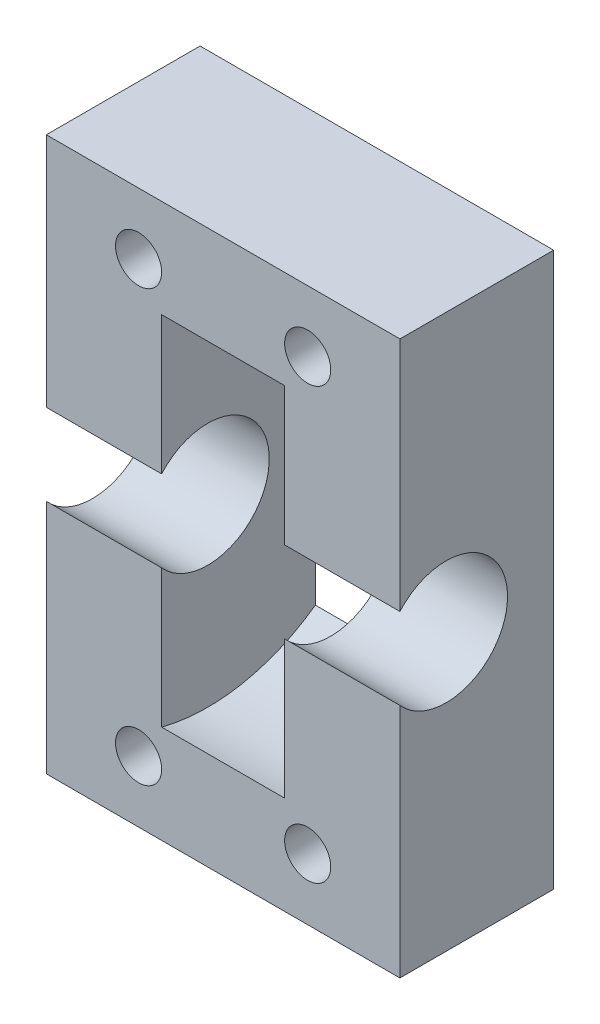
ISO-10303-21;
HEADER;
FILE_DESCRIPTION(('STEP AP214'),'2;1');
FILE_NAME('part.step','',(''),(''),'','','');
FILE_SCHEMA(('AUTOMOTIVE_DESIGN { 1 0 10303 214 1 1 1 1 }'));
ENDSEC;
DATA;
#1=APPLICATION_CONTEXT('core data for automotive mechanical design processes');
#2=APPLICATION_PROTOCOL_DEFINITION('international standard','automotive_design',2000,#1);
#3=PRODUCT_CONTEXT('',#1,'mechanical');
#4=PRODUCT('Part','Part','',(#3));
#5=PRODUCT_RELATED_PRODUCT_CATEGORY('part','',(#4));
#6=PRODUCT_DEFINITION_FORMATION('','',#4);
#7=PRODUCT_DEFINITION_CONTEXT('part definition',#1,'design');
#8=PRODUCT_DEFINITION('design','',#6,#7);
#9=PRODUCT_DEFINITION_SHAPE('','',#8);
#10=(LENGTH_UNIT() NAMED_UNIT(*) SI_UNIT(.MILLI.,.METRE.));
#11=(NAMED_UNIT(*) PLANE_ANGLE_UNIT() SI_UNIT($,.RADIAN.));
#12=(NAMED_UNIT(*) SI_UNIT($,.STERADIAN.) SOLID_ANGLE_UNIT());
#13=UNCERTAINTY_MEASURE_WITH_UNIT(LENGTH_MEASURE(1.E-05),#10,'distance_accuracy_value','');
#14=(GEOMETRIC_REPRESENTATION_CONTEXT(3) GLOBAL_UNCERTAINTY_ASSIGNED_CONTEXT((#13)) GLOBAL_UNIT_ASSIGNED_CONTEXT((#10,
#11,#12)) REPRESENTATION_CONTEXT('',''));
#15=CARTESIAN_POINT('',(0.,0.,0.));
#16=DIRECTION('',(0.,0.,1.));
#17=DIRECTION('',(1.,0.,0.));
#18=AXIS2_PLACEMENT_3D('',#15,#16,#17);
#19=CARTESIAN_POINT('',(23.,17.9999999999999,7.));
#20=DIRECTION('',(-1.,0.,0.));
#21=DIRECTION('',(0.,0.,1.));
#22=AXIS2_PLACEMENT_3D('',#19,#20,#21);
#23=CYLINDRICAL_SURFACE('',#22,4.);
#24=DIRECTION('',(-1.,0.,0.));
#25=VECTOR('',#24,1.);
#26=CARTESIAN_POINT('',(0.,20.6457513110646,9.99999999999999));
#27=LINE('',#26,#25);
#28=CARTESIAN_POINT('',(7.50000000000001,20.6457513110645,9.99999999999999));
#29=VERTEX_POINT('',#28);
#30=CARTESIAN_POINT('',(0.,20.6457513110645,9.99999999999999));
#31=VERTEX_POINT('',#30);
#32=EDGE_CURVE('E149',#29,#31,#27,.T.);
#33=ORIENTED_EDGE('',*,*,#32,.T.);
#34=CARTESIAN_POINT('',(0.,17.9999999999999,7.));
#35=DIRECTION('',(-1.,0.,0.));
#36=DIRECTION('',(0.,0.,1.));
#37=AXIS2_PLACEMENT_3D('',#34,#35,#36);
#38=CIRCLE('',#37,4.);
#39=CARTESIAN_POINT('',(0.,15.3542486889353,9.99999999999999));
#40=VERTEX_POINT('',#39);
#41=EDGE_CURVE('E225',#31,#40,#38,.T.);
#42=ORIENTED_EDGE('',*,*,#41,.T.);
#43=DIRECTION('',(-1.,0.,0.));
#44=VECTOR('',#43,1.);
#45=CARTESIAN_POINT('',(0.,15.3542486889353,9.99999999999999));
#46=LINE('',#45,#44);
#47=CARTESIAN_POINT('',(7.50000000000001,15.3542486889353,9.99999999999999));
#48=VERTEX_POINT('',#47);
#49=EDGE_CURVE('E126',#40,#48,#46,.F.);
#50=ORIENTED_EDGE('',*,*,#49,.T.);
#51=CARTESIAN_POINT('',(7.50000000000001,17.9999999999999,7.));
#52=DIRECTION('',(-1.,0.,0.));
#53=DIRECTION('',(0.,0.,1.));
#54=AXIS2_PLACEMENT_3D('',#51,#52,#53);
#55=CIRCLE('',#54,4.);
#56=EDGE_CURVE('E234',#29,#48,#55,.T.);
#57=ORIENTED_EDGE('',*,*,#56,.F.);
#58=EDGE_LOOP('',(#33,#42,#50,#57));
#59=FACE_BOUND('',#58,.T.);
#60=ADVANCED_FACE('F16',(#59),#23,.F.);
#61=CARTESIAN_POINT('',(23.,17.9999999999999,7.));
#62=DIRECTION('',(-1.,0.,0.));
#63=DIRECTION('',(0.,0.,1.));
#64=AXIS2_PLACEMENT_3D('',#61,#62,#63);
#65=CYLINDRICAL_SURFACE('',#64,4.);
#66=CARTESIAN_POINT('',(15.5,17.9999999999999,7.));
#67=DIRECTION('',(-1.,0.,0.));
#68=DIRECTION('',(0.,0.,1.));
#69=AXIS2_PLACEMENT_3D('',#66,#67,#68);
#70=CIRCLE('',#69,4.);
#71=CARTESIAN_POINT('',(15.5,20.6457513110645,9.99999999999999));
#72=VERTEX_POINT('',#71);
#73=CARTESIAN_POINT('',(15.5,15.3542486889353,9.99999999999999));
#74=VERTEX_POINT('',#73);
#75=EDGE_CURVE('E107',#72,#74,#70,.T.);
#76=ORIENTED_EDGE('',*,*,#75,.T.);
#77=DIRECTION('',(-1.,0.,0.));
#78=VECTOR('',#77,1.);
#79=CARTESIAN_POINT('',(0.,15.3542486889353,9.99999999999999));
#80=LINE('',#79,#78);
#81=CARTESIAN_POINT('',(23.,15.3542486889353,9.99999999999999));
#82=VERTEX_POINT('',#81);
#83=EDGE_CURVE('E110',#74,#82,#80,.F.);
#84=ORIENTED_EDGE('',*,*,#83,.T.);
#85=CARTESIAN_POINT('',(23.,17.9999999999999,7.));
#86=DIRECTION('',(-1.,0.,0.));
#87=DIRECTION('',(0.,0.,1.));
#88=AXIS2_PLACEMENT_3D('',#85,#86,#87);
#89=CIRCLE('',#88,4.);
#90=CARTESIAN_POINT('',(23.,20.6457513110645,9.99999999999999));
#91=VERTEX_POINT('',#90);
#92=EDGE_CURVE('E222',#82,#91,#89,.F.);
#93=ORIENTED_EDGE('',*,*,#92,.T.);
#94=DIRECTION('',(-1.,0.,0.));
#95=VECTOR('',#94,1.);
#96=CARTESIAN_POINT('',(0.,20.6457513110645,9.99999999999999));
#97=LINE('',#96,#95);
#98=EDGE_CURVE('E104',#91,#72,#97,.T.);
#99=ORIENTED_EDGE('',*,*,#98,.T.);
#100=EDGE_LOOP('',(#76,#84,#93,#99));
#101=FACE_BOUND('',#100,.T.);
#102=ADVANCED_FACE('F109',(#101),#65,.F.);
#103=CARTESIAN_POINT('',(0.,35.9999999999999,9.99999999999999));
#104=DIRECTION('',(0.,0.,-1.));
#105=DIRECTION('',(-1.,0.,0.));
#106=AXIS2_PLACEMENT_3D('',#103,#104,#105);
#107=PLANE('',#106);
#108=DIRECTION('',(0.,1.,0.));
#109=VECTOR('',#108,1.);
#110=CARTESIAN_POINT('',(15.5,17.9999999999998,10.));
#111=LINE('',#110,#109);
#112=CARTESIAN_POINT('',(15.5000000000001,29.618950038622,9.99999999999999));
#113=VERTEX_POINT('',#112);
#114=EDGE_CURVE('E116',#113,#72,#111,.F.);
#115=ORIENTED_EDGE('',*,*,#114,.T.);
#116=ORIENTED_EDGE('',*,*,#98,.F.);
#117=DIRECTION('',(0.,1.,0.));
#118=VECTOR('',#117,1.);
#119=CARTESIAN_POINT('',(23.,0.,9.99999999999999));
#120=LINE('',#119,#118);
#121=CARTESIAN_POINT('',(23.,35.9999999999999,10.));
#122=VERTEX_POINT('',#121);
#123=EDGE_CURVE('E194',#91,#122,#120,.T.);
#124=ORIENTED_EDGE('',*,*,#123,.T.);
#125=DIRECTION('',(1.,0.,0.));
#126=VECTOR('',#125,1.);
#127=CARTESIAN_POINT('',(0.,35.9999999999999,10.));
#128=LINE('',#127,#126);
#129=CARTESIAN_POINT('',(0.,35.9999999999999,9.99999999999999));
#130=VERTEX_POINT('',#129);
#131=EDGE_CURVE('E167',#122,#130,#128,.F.);
#132=ORIENTED_EDGE('',*,*,#131,.T.);
#133=DIRECTION('',(0.,1.,0.));
#134=VECTOR('',#133,1.);
#135=CARTESIAN_POINT('',(0.,0.,9.99999999999999));
#136=LINE('',#135,#134);
#137=EDGE_CURVE('E202',#130,#31,#136,.F.);
#138=ORIENTED_EDGE('',*,*,#137,.T.);
#139=ORIENTED_EDGE('',*,*,#32,.F.);
#140=DIRECTION('',(0.,1.,0.));
#141=VECTOR('',#140,1.);
#142=CARTESIAN_POINT('',(7.50000000000001,17.9999999999999,10.));
#143=LINE('',#142,#141);
#144=CARTESIAN_POINT('',(7.50000000000001,29.618950038622,9.99999999999997));
#145=VERTEX_POINT('',#144);
#146=EDGE_CURVE('E238',#145,#29,#143,.F.);
#147=ORIENTED_EDGE('',*,*,#146,.F.);
#148=DIRECTION('',(-1.,0.,0.));
#149=VECTOR('',#148,1.);
#150=CARTESIAN_POINT('',(15.5,29.618950038622,9.99999999999994));
#151=LINE('',#150,#149);
#152=EDGE_CURVE('E138',#145,#113,#151,.F.);
#153=ORIENTED_EDGE('',*,*,#152,.T.);
#154=EDGE_LOOP('',(#115,#116,#124,#132,#138,#139,#147,#153));
#155=FACE_BOUND('',#154,.T.);
#156=CARTESIAN_POINT('',(5.99999999999998,32.,10.));
#157=DIRECTION('',(0.,0.,1.));
#158=DIRECTION('',(1.,0.,0.));
#159=AXIS2_PLACEMENT_3D('',#156,#157,#158);
#160=CIRCLE('',#159,1.5);
#161=CARTESIAN_POINT('',(7.49999999999998,32.,10.));
#162=VERTEX_POINT('',#161);
#163=EDGE_CURVE('E146',#162,#162,#160,.F.);
#164=ORIENTED_EDGE('',*,*,#163,.T.);
#165=EDGE_LOOP('',(#164));
#166=FACE_BOUND('',#165,.T.);
#167=CARTESIAN_POINT('',(17.,32.,10.));
#168=DIRECTION('',(0.,0.,1.));
#169=DIRECTION('',(1.,0.,0.));
#170=AXIS2_PLACEMENT_3D('',#167,#168,#169);
#171=CIRCLE('',#170,1.5);
#172=CARTESIAN_POINT('',(18.5,32.,10.));
#173=VERTEX_POINT('',#172);
#174=EDGE_CURVE('E245',#173,#173,#171,.F.);
#175=ORIENTED_EDGE('',*,*,#174,.T.);
#176=EDGE_LOOP('',(#175));
#177=FACE_BOUND('',#176,.T.);
#178=ADVANCED_FACE('F317',(#155,#166,#177),#107,.F.);
#179=CARTESIAN_POINT('',(0.,35.9999999999999,9.99999999999999));
#180=DIRECTION('',(0.,0.,-1.));
#181=DIRECTION('',(-1.,0.,0.));
#182=AXIS2_PLACEMENT_3D('',#179,#180,#181);
#183=PLANE('',#182);
#184=DIRECTION('',(0.,1.,0.));
#185=VECTOR('',#184,1.);
#186=CARTESIAN_POINT('',(15.5,17.9999999999998,9.99999999999999));
#187=LINE('',#186,#185);
#188=CARTESIAN_POINT('',(15.5,6.38104996137751,10.));
#189=VERTEX_POINT('',#188);
#190=EDGE_CURVE('E115',#74,#189,#187,.F.);
#191=ORIENTED_EDGE('',*,*,#190,.T.);
#192=DIRECTION('',(-1.,0.,0.));
#193=VECTOR('',#192,1.);
#194=CARTESIAN_POINT('',(15.5,6.38104996137752,10.));
#195=LINE('',#194,#193);
#196=CARTESIAN_POINT('',(7.50000000000001,6.38104996137751,10.));
#197=VERTEX_POINT('',#196);
#198=EDGE_CURVE('E199',#189,#197,#195,.T.);
#199=ORIENTED_EDGE('',*,*,#198,.T.);
#200=DIRECTION('',(0.,1.,0.));
#201=VECTOR('',#200,1.);
#202=CARTESIAN_POINT('',(7.50000000000001,17.9999999999999,9.99999999999999));
#203=LINE('',#202,#201);
#204=EDGE_CURVE('E233',#48,#197,#203,.F.);
#205=ORIENTED_EDGE('',*,*,#204,.F.);
#206=ORIENTED_EDGE('',*,*,#49,.F.);
#207=DIRECTION('',(0.,1.,0.));
#208=VECTOR('',#207,1.);
#209=CARTESIAN_POINT('',(0.,0.,10.));
#210=LINE('',#209,#208);
#211=CARTESIAN_POINT('',(0.,0.,10.));
#212=VERTEX_POINT('',#211);
#213=EDGE_CURVE('E170',#40,#212,#210,.F.);
#214=ORIENTED_EDGE('',*,*,#213,.T.);
#215=DIRECTION('',(-1.,0.,0.));
#216=VECTOR('',#215,1.);
#217=CARTESIAN_POINT('',(0.,0.,10.));
#218=LINE('',#217,#216);
#219=CARTESIAN_POINT('',(23.,0.,10.));
#220=VERTEX_POINT('',#219);
#221=EDGE_CURVE('E156',#212,#220,#218,.F.);
#222=ORIENTED_EDGE('',*,*,#221,.T.);
#223=DIRECTION('',(0.,1.,0.));
#224=VECTOR('',#223,1.);
#225=CARTESIAN_POINT('',(23.,0.,10.));
#226=LINE('',#225,#224);
#227=EDGE_CURVE('E123',#220,#82,#226,.T.);
#228=ORIENTED_EDGE('',*,*,#227,.T.);
#229=ORIENTED_EDGE('',*,*,#83,.F.);
#230=EDGE_LOOP('',(#191,#199,#205,#206,#214,#222,#228,#229));
#231=FACE_BOUND('',#230,.T.);
#232=CARTESIAN_POINT('',(17.,4.,10.));
#233=DIRECTION('',(0.,0.,1.));
#234=DIRECTION('',(1.,0.,0.));
#235=AXIS2_PLACEMENT_3D('',#232,#233,#234);
#236=CIRCLE('',#235,1.5);
#237=CARTESIAN_POINT('',(18.5,4.,10.));
#238=VERTEX_POINT('',#237);
#239=EDGE_CURVE('E248',#238,#238,#236,.F.);
#240=ORIENTED_EDGE('',*,*,#239,.T.);
#241=EDGE_LOOP('',(#240));
#242=FACE_BOUND('',#241,.T.);
#243=CARTESIAN_POINT('',(6.00000000000001,4.,10.));
#244=DIRECTION('',(0.,0.,1.));
#245=DIRECTION('',(1.,0.,0.));
#246=AXIS2_PLACEMENT_3D('',#243,#244,#245);
#247=CIRCLE('',#246,1.5);
#248=CARTESIAN_POINT('',(7.50000000000001,4.,10.));
#249=VERTEX_POINT('',#248);
#250=EDGE_CURVE('E19',#249,#249,#247,.F.);
#251=ORIENTED_EDGE('',*,*,#250,.T.);
#252=EDGE_LOOP('',(#251));
#253=FACE_BOUND('',#252,.T.);
#254=ADVANCED_FACE('F119',(#231,#242,#253),#183,.F.);
#255=CARTESIAN_POINT('',(6.00000000000001,4.,0.));
#256=DIRECTION('',(0.,0.,1.));
#257=DIRECTION('',(1.,0.,0.));
#258=AXIS2_PLACEMENT_3D('',#255,#256,#257);
#259=CYLINDRICAL_SURFACE('',#258,1.5);
#260=ORIENTED_EDGE('',*,*,#250,.F.);
#261=EDGE_LOOP('',(#260));
#262=FACE_BOUND('',#261,.T.);
#263=CARTESIAN_POINT('',(6.00000000000001,4.,0.));
#264=DIRECTION('',(0.,0.,1.));
#265=DIRECTION('',(1.,0.,0.));
#266=AXIS2_PLACEMENT_3D('',#263,#264,#265);
#267=CIRCLE('',#266,1.5);
#268=CARTESIAN_POINT('',(7.50000000000001,4.,0.));
#269=VERTEX_POINT('',#268);
#270=EDGE_CURVE('E164',#269,#269,#267,.T.);
#271=ORIENTED_EDGE('',*,*,#270,.F.);
#272=EDGE_LOOP('',(#271));
#273=FACE_BOUND('',#272,.T.);
#274=ADVANCED_FACE('F259',(#262,#273),#259,.F.);
#275=CARTESIAN_POINT('',(17.,4.,0.));
#276=DIRECTION('',(0.,0.,1.));
#277=DIRECTION('',(1.,0.,0.));
#278=AXIS2_PLACEMENT_3D('',#275,#276,#277);
#279=CYLINDRICAL_SURFACE('',#278,1.5);
#280=ORIENTED_EDGE('',*,*,#239,.F.);
#281=EDGE_LOOP('',(#280));
#282=FACE_BOUND('',#281,.T.);
#283=CARTESIAN_POINT('',(17.,4.,0.));
#284=DIRECTION('',(0.,0.,1.));
#285=DIRECTION('',(1.,0.,0.));
#286=AXIS2_PLACEMENT_3D('',#283,#284,#285);
#287=CIRCLE('',#286,1.5);
#288=CARTESIAN_POINT('',(18.5,4.,0.));
#289=VERTEX_POINT('',#288);
#290=EDGE_CURVE('E215',#289,#289,#287,.T.);
#291=ORIENTED_EDGE('',*,*,#290,.F.);
#292=EDGE_LOOP('',(#291));
#293=FACE_BOUND('',#292,.T.);
#294=ADVANCED_FACE('F262',(#282,#293),#279,.F.);
#295=CARTESIAN_POINT('',(17.,32.,0.));
#296=DIRECTION('',(0.,0.,1.));
#297=DIRECTION('',(1.,0.,0.));
#298=AXIS2_PLACEMENT_3D('',#295,#296,#297);
#299=CYLINDRICAL_SURFACE('',#298,1.5);
#300=ORIENTED_EDGE('',*,*,#174,.F.);
#301=EDGE_LOOP('',(#300));
#302=FACE_BOUND('',#301,.T.);
#303=CARTESIAN_POINT('',(17.,32.,0.));
#304=DIRECTION('',(0.,0.,1.));
#305=DIRECTION('',(1.,0.,0.));
#306=AXIS2_PLACEMENT_3D('',#303,#304,#305);
#307=CIRCLE('',#306,1.5);
#308=CARTESIAN_POINT('',(18.5,32.,0.));
#309=VERTEX_POINT('',#308);
#310=EDGE_CURVE('E211',#309,#309,#307,.T.);
#311=ORIENTED_EDGE('',*,*,#310,.F.);
#312=EDGE_LOOP('',(#311));
#313=FACE_BOUND('',#312,.T.);
#314=ADVANCED_FACE('F307',(#302,#313),#299,.F.);
#315=CARTESIAN_POINT('',(5.99999999999998,32.,0.));
#316=DIRECTION('',(0.,0.,1.));
#317=DIRECTION('',(1.,0.,0.));
#318=AXIS2_PLACEMENT_3D('',#315,#316,#317);
#319=CYLINDRICAL_SURFACE('',#318,1.5);
#320=ORIENTED_EDGE('',*,*,#163,.F.);
#321=EDGE_LOOP('',(#320));
#322=FACE_BOUND('',#321,.T.);
#323=CARTESIAN_POINT('',(5.99999999999998,32.,0.));
#324=DIRECTION('',(0.,0.,1.));
#325=DIRECTION('',(1.,0.,0.));
#326=AXIS2_PLACEMENT_3D('',#323,#324,#325);
#327=CIRCLE('',#326,1.5);
#328=CARTESIAN_POINT('',(7.49999999999998,32.,0.));
#329=VERTEX_POINT('',#328);
#330=EDGE_CURVE('E207',#329,#329,#327,.T.);
#331=ORIENTED_EDGE('',*,*,#330,.F.);
#332=EDGE_LOOP('',(#331));
#333=FACE_BOUND('',#332,.T.);
#334=ADVANCED_FACE('F304',(#322,#333),#319,.F.);
#335=CARTESIAN_POINT('',(15.5,17.9999999999998,7.));
#336=DIRECTION('',(1.,0.,0.));
#337=DIRECTION('',(0.,0.,-1.));
#338=AXIS2_PLACEMENT_3D('',#335,#336,#337);
#339=PLANE('',#338);
#340=CARTESIAN_POINT('',(15.5,17.9999999999998,7.));
#341=DIRECTION('',(-1.,0.,0.));
#342=DIRECTION('',(0.,0.,1.));
#343=AXIS2_PLACEMENT_3D('',#340,#341,#342);
#344=CIRCLE('',#343,12.);
#345=CARTESIAN_POINT('',(15.5,8.25320565519091,0.));
#346=VERTEX_POINT('',#345);
#347=EDGE_CURVE('E130',#346,#189,#344,.T.);
#348=ORIENTED_EDGE('',*,*,#347,.T.);
#349=ORIENTED_EDGE('',*,*,#190,.F.);
#350=ORIENTED_EDGE('',*,*,#75,.F.);
#351=ORIENTED_EDGE('',*,*,#114,.F.);
#352=CARTESIAN_POINT('',(15.5000000000002,17.9999999999998,7.));
#353=DIRECTION('',(-1.,0.,0.));
#354=DIRECTION('',(0.,0.,1.));
#355=AXIS2_PLACEMENT_3D('',#352,#353,#354);
#356=CIRCLE('',#355,12.);
#357=CARTESIAN_POINT('',(15.5000000000001,27.7467943448088,0.));
#358=VERTEX_POINT('',#357);
#359=EDGE_CURVE('E133',#113,#358,#356,.T.);
#360=ORIENTED_EDGE('',*,*,#359,.T.);
#361=DIRECTION('',(0.,1.,0.));
#362=VECTOR('',#361,1.);
#363=CARTESIAN_POINT('',(15.5,35.9999999999999,0.));
#364=LINE('',#363,#362);
#365=EDGE_CURVE('E142',#346,#358,#364,.T.);
#366=ORIENTED_EDGE('',*,*,#365,.F.);
#367=EDGE_LOOP('',(#348,#349,#350,#351,#360,#366));
#368=FACE_BOUND('',#367,.T.);
#369=ADVANCED_FACE('F128',(#368),#339,.F.);
#370=CARTESIAN_POINT('',(15.5,17.9999999999998,7.));
#371=DIRECTION('',(-1.,0.,0.));
#372=DIRECTION('',(0.,0.,1.));
#373=AXIS2_PLACEMENT_3D('',#370,#371,#372);
#374=CYLINDRICAL_SURFACE('',#373,12.);
#375=CARTESIAN_POINT('',(7.50000000000001,17.9999999999998,7.));
#376=DIRECTION('',(-1.,0.,0.));
#377=DIRECTION('',(0.,0.,1.));
#378=AXIS2_PLACEMENT_3D('',#375,#376,#377);
#379=CIRCLE('',#378,12.);
#380=CARTESIAN_POINT('',(7.50000000000001,27.7467943448088,0.));
#381=VERTEX_POINT('',#380);
#382=EDGE_CURVE('E206',#381,#145,#379,.F.);
#383=ORIENTED_EDGE('',*,*,#382,.F.);
#384=DIRECTION('',(-1.,0.,0.));
#385=VECTOR('',#384,1.);
#386=CARTESIAN_POINT('',(0.,27.7467943448088,0.));
#387=LINE('',#386,#385);
#388=EDGE_CURVE('E357',#358,#381,#387,.T.);
#389=ORIENTED_EDGE('',*,*,#388,.F.);
#390=ORIENTED_EDGE('',*,*,#359,.F.);
#391=ORIENTED_EDGE('',*,*,#152,.F.);
#392=EDGE_LOOP('',(#383,#389,#390,#391));
#393=FACE_BOUND('',#392,.T.);
#394=ADVANCED_FACE('F297',(#393),#374,.F.);
#395=CARTESIAN_POINT('',(7.50000000000001,17.9999999999999,7.00000000000001));
#396=DIRECTION('',(1.,0.,0.));
#397=DIRECTION('',(0.,0.,-1.));
#398=AXIS2_PLACEMENT_3D('',#395,#396,#397);
#399=PLANE('',#398);
#400=CARTESIAN_POINT('',(7.50000000000001,17.9999999999998,7.));
#401=DIRECTION('',(-1.,0.,0.));
#402=DIRECTION('',(0.,0.,1.));
#403=AXIS2_PLACEMENT_3D('',#400,#401,#402);
#404=CIRCLE('',#403,12.);
#405=CARTESIAN_POINT('',(7.50000000000001,8.25320565519091,0.));
#406=VERTEX_POINT('',#405);
#407=EDGE_CURVE('E230',#197,#406,#404,.F.);
#408=ORIENTED_EDGE('',*,*,#407,.T.);
#409=DIRECTION('',(0.,1.,0.));
#410=VECTOR('',#409,1.);
#411=CARTESIAN_POINT('',(7.50000000000001,35.9999999999999,0.));
#412=LINE('',#411,#410);
#413=EDGE_CURVE('E361',#381,#406,#412,.F.);
#414=ORIENTED_EDGE('',*,*,#413,.F.);
#415=ORIENTED_EDGE('',*,*,#382,.T.);
#416=ORIENTED_EDGE('',*,*,#146,.T.);
#417=ORIENTED_EDGE('',*,*,#56,.T.);
#418=ORIENTED_EDGE('',*,*,#204,.T.);
#419=EDGE_LOOP('',(#408,#414,#415,#416,#417,#418));
#420=FACE_BOUND('',#419,.T.);
#421=ADVANCED_FACE('F293',(#420),#399,.T.);
#422=CARTESIAN_POINT('',(15.5,17.9999999999998,7.));
#423=DIRECTION('',(-1.,0.,0.));
#424=DIRECTION('',(0.,0.,1.));
#425=AXIS2_PLACEMENT_3D('',#422,#423,#424);
#426=CYLINDRICAL_SURFACE('',#425,12.);
#427=ORIENTED_EDGE('',*,*,#347,.F.);
#428=DIRECTION('',(-1.,0.,0.));
#429=VECTOR('',#428,1.);
#430=CARTESIAN_POINT('',(0.,8.25320565519103,0.));
#431=LINE('',#430,#429);
#432=EDGE_CURVE('E364',#406,#346,#431,.F.);
#433=ORIENTED_EDGE('',*,*,#432,.F.);
#434=ORIENTED_EDGE('',*,*,#407,.F.);
#435=ORIENTED_EDGE('',*,*,#198,.F.);
#436=EDGE_LOOP('',(#427,#433,#434,#435));
#437=FACE_BOUND('',#436,.T.);
#438=ADVANCED_FACE('F289',(#437),#426,.F.);
#439=CARTESIAN_POINT('',(0.,0.,10.));
#440=DIRECTION('',(1.,0.,0.));
#441=DIRECTION('',(0.,0.,-1.));
#442=AXIS2_PLACEMENT_3D('',#439,#440,#441);
#443=PLANE('',#442);
#444=ORIENTED_EDGE('',*,*,#41,.F.);
#445=ORIENTED_EDGE('',*,*,#137,.F.);
#446=DIRECTION('',(0.,0.,1.));
#447=VECTOR('',#446,1.);
#448=CARTESIAN_POINT('',(0.,35.9999999999999,9.99999999999999));
#449=LINE('',#448,#447);
#450=CARTESIAN_POINT('',(0.,35.9999999999999,0.));
#451=VERTEX_POINT('',#450);
#452=EDGE_CURVE('E153',#130,#451,#449,.F.);
#453=ORIENTED_EDGE('',*,*,#452,.T.);
#454=DIRECTION('',(0.,1.,0.));
#455=VECTOR('',#454,1.);
#456=CARTESIAN_POINT('',(0.,35.9999999999999,0.));
#457=LINE('',#456,#455);
#458=CARTESIAN_POINT('',(0.,0.,0.));
#459=VERTEX_POINT('',#458);
#460=EDGE_CURVE('E182',#459,#451,#457,.T.);
#461=ORIENTED_EDGE('',*,*,#460,.F.);
#462=DIRECTION('',(0.,0.,1.));
#463=VECTOR('',#462,1.);
#464=CARTESIAN_POINT('',(0.,0.,10.));
#465=LINE('',#464,#463);
#466=EDGE_CURVE('E159',#459,#212,#465,.T.);
#467=ORIENTED_EDGE('',*,*,#466,.T.);
#468=ORIENTED_EDGE('',*,*,#213,.F.);
#469=EDGE_LOOP('',(#444,#445,#453,#461,#467,#468));
#470=FACE_BOUND('',#469,.T.);
#471=ADVANCED_FACE('F285',(#470),#443,.F.);
#472=CARTESIAN_POINT('',(0.,35.9999999999999,9.99999999999999));
#473=DIRECTION('',(0.,-1.,0.));
#474=DIRECTION('',(1.,0.,0.));
#475=AXIS2_PLACEMENT_3D('',#472,#473,#474);
#476=PLANE('',#475);
#477=ORIENTED_EDGE('',*,*,#452,.F.);
#478=ORIENTED_EDGE('',*,*,#131,.F.);
#479=DIRECTION('',(0.,0.,1.));
#480=VECTOR('',#479,1.);
#481=CARTESIAN_POINT('',(23.,35.9999999999999,10.));
#482=LINE('',#481,#480);
#483=CARTESIAN_POINT('',(23.,35.9999999999999,0.));
#484=VERTEX_POINT('',#483);
#485=EDGE_CURVE('E150',#122,#484,#482,.F.);
#486=ORIENTED_EDGE('',*,*,#485,.T.);
#487=DIRECTION('',(-1.,0.,0.));
#488=VECTOR('',#487,1.);
#489=CARTESIAN_POINT('',(0.,35.9999999999999,0.));
#490=LINE('',#489,#488);
#491=EDGE_CURVE('E176',#451,#484,#490,.F.);
#492=ORIENTED_EDGE('',*,*,#491,.F.);
#493=EDGE_LOOP('',(#477,#478,#486,#492));
#494=FACE_BOUND('',#493,.T.);
#495=ADVANCED_FACE('F282',(#494),#476,.F.);
#496=CARTESIAN_POINT('',(23.,0.,10.));
#497=DIRECTION('',(-1.,0.,0.));
#498=DIRECTION('',(0.,0.,1.));
#499=AXIS2_PLACEMENT_3D('',#496,#497,#498);
#500=PLANE('',#499);
#501=ORIENTED_EDGE('',*,*,#92,.F.);
#502=ORIENTED_EDGE('',*,*,#227,.F.);
#503=DIRECTION('',(0.,0.,1.));
#504=VECTOR('',#503,1.);
#505=CARTESIAN_POINT('',(23.,0.,10.));
#506=LINE('',#505,#504);
#507=CARTESIAN_POINT('',(23.,0.,0.));
#508=VERTEX_POINT('',#507);
#509=EDGE_CURVE('E35',#220,#508,#506,.F.);
#510=ORIENTED_EDGE('',*,*,#509,.T.);
#511=DIRECTION('',(0.,1.,0.));
#512=VECTOR('',#511,1.);
#513=CARTESIAN_POINT('',(23.,35.9999999999999,0.));
#514=LINE('',#513,#512);
#515=EDGE_CURVE('E26',#484,#508,#514,.F.);
#516=ORIENTED_EDGE('',*,*,#515,.F.);
#517=ORIENTED_EDGE('',*,*,#485,.F.);
#518=ORIENTED_EDGE('',*,*,#123,.F.);
#519=EDGE_LOOP('',(#501,#502,#510,#516,#517,#518));
#520=FACE_BOUND('',#519,.T.);
#521=ADVANCED_FACE('F275',(#520),#500,.F.);
#522=CARTESIAN_POINT('',(0.,0.,10.));
#523=DIRECTION('',(0.,1.,0.));
#524=DIRECTION('',(-1.,0.,0.));
#525=AXIS2_PLACEMENT_3D('',#522,#523,#524);
#526=PLANE('',#525);
#527=ORIENTED_EDGE('',*,*,#509,.F.);
#528=ORIENTED_EDGE('',*,*,#221,.F.);
#529=ORIENTED_EDGE('',*,*,#466,.F.);
#530=DIRECTION('',(-1.,0.,0.));
#531=VECTOR('',#530,1.);
#532=CARTESIAN_POINT('',(0.,0.,0.));
#533=LINE('',#532,#531);
#534=EDGE_CURVE('E11',#508,#459,#533,.T.);
#535=ORIENTED_EDGE('',*,*,#534,.F.);
#536=EDGE_LOOP('',(#527,#528,#529,#535));
#537=FACE_BOUND('',#536,.T.);
#538=ADVANCED_FACE('F268',(#537),#526,.F.);
#539=CARTESIAN_POINT('',(0.,35.9999999999999,0.));
#540=DIRECTION('',(0.,0.,-1.));
#541=DIRECTION('',(-1.,0.,0.));
#542=AXIS2_PLACEMENT_3D('',#539,#540,#541);
#543=PLANE('',#542);
#544=ORIENTED_EDGE('',*,*,#515,.T.);
#545=ORIENTED_EDGE('',*,*,#534,.T.);
#546=ORIENTED_EDGE('',*,*,#460,.T.);
#547=ORIENTED_EDGE('',*,*,#491,.T.);
#548=EDGE_LOOP('',(#544,#545,#546,#547));
#549=FACE_BOUND('',#548,.T.);
#550=ORIENTED_EDGE('',*,*,#413,.T.);
#551=ORIENTED_EDGE('',*,*,#432,.T.);
#552=ORIENTED_EDGE('',*,*,#365,.T.);
#553=ORIENTED_EDGE('',*,*,#388,.T.);
#554=EDGE_LOOP('',(#550,#551,#552,#553));
#555=FACE_BOUND('',#554,.T.);
#556=ORIENTED_EDGE('',*,*,#330,.T.);
#557=EDGE_LOOP('',(#556));
#558=FACE_BOUND('',#557,.T.);
#559=ORIENTED_EDGE('',*,*,#310,.T.);
#560=EDGE_LOOP('',(#559));
#561=FACE_BOUND('',#560,.T.);
#562=ORIENTED_EDGE('',*,*,#290,.T.);
#563=EDGE_LOOP('',(#562));
#564=FACE_BOUND('',#563,.T.);
#565=ORIENTED_EDGE('',*,*,#270,.T.);
#566=EDGE_LOOP('',(#565));
#567=FACE_BOUND('',#566,.T.);
#568=ADVANCED_FACE('F266',(#549,#555,#558,#561,#564,#567),#543,.T.);
#569=CLOSED_SHELL('',(#60,#102,#178,#254,#274,#294,#314,#334,#369,#394,#421,#438,#471,#495,#521,
#538,#568));
#570=MANIFOLD_SOLID_BREP('B1',#569);
#571=ADVANCED_BREP_SHAPE_REPRESENTATION('',(#18,#570),#14);
#572=SHAPE_DEFINITION_REPRESENTATION(#9,#571);
ENDSEC;
END-ISO-10303-21;
